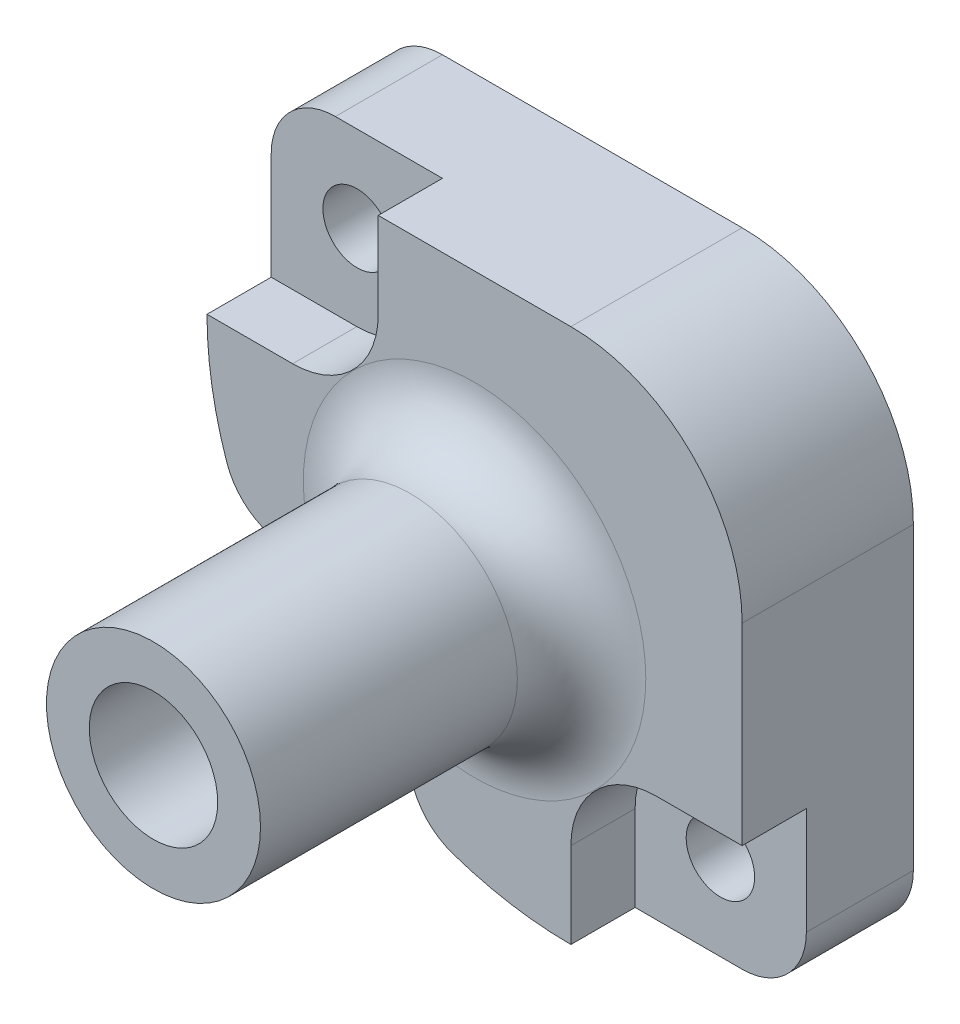
ISO-10303-21;
HEADER;
FILE_DESCRIPTION(('STEP AP214'),'2;1');
FILE_NAME('part.step','',(''),(''),'','','');
FILE_SCHEMA(('AUTOMOTIVE_DESIGN { 1 0 10303 214 1 1 1 1 }'));
ENDSEC;
DATA;
#1=APPLICATION_CONTEXT('core data for automotive mechanical design processes');
#2=APPLICATION_PROTOCOL_DEFINITION('international standard','automotive_design',2000,#1);
#3=PRODUCT_CONTEXT('',#1,'mechanical');
#4=PRODUCT('Part','Part','',(#3));
#5=PRODUCT_RELATED_PRODUCT_CATEGORY('part','',(#4));
#6=PRODUCT_DEFINITION_FORMATION('','',#4);
#7=PRODUCT_DEFINITION_CONTEXT('part definition',#1,'design');
#8=PRODUCT_DEFINITION('design','',#6,#7);
#9=PRODUCT_DEFINITION_SHAPE('','',#8);
#10=(LENGTH_UNIT() NAMED_UNIT(*) SI_UNIT(.MILLI.,.METRE.));
#11=(NAMED_UNIT(*) PLANE_ANGLE_UNIT() SI_UNIT($,.RADIAN.));
#12=(NAMED_UNIT(*) SI_UNIT($,.STERADIAN.) SOLID_ANGLE_UNIT());
#13=UNCERTAINTY_MEASURE_WITH_UNIT(LENGTH_MEASURE(1.E-05),#10,'distance_accuracy_value','');
#14=(GEOMETRIC_REPRESENTATION_CONTEXT(3) GLOBAL_UNCERTAINTY_ASSIGNED_CONTEXT((#13)) GLOBAL_UNIT_ASSIGNED_CONTEXT((#10,
#11,#12)) REPRESENTATION_CONTEXT('',''));
#15=CARTESIAN_POINT('',(0.,0.,0.));
#16=DIRECTION('',(0.,0.,1.));
#17=DIRECTION('',(1.,0.,0.));
#18=AXIS2_PLACEMENT_3D('',#15,#16,#17);
#19=CARTESIAN_POINT('',(0.,0.,8.));
#20=DIRECTION('',(0.,0.,1.));
#21=DIRECTION('',(1.,0.,0.));
#22=AXIS2_PLACEMENT_3D('',#19,#20,#21);
#23=PLANE('',#22);
#24=DIRECTION('',(0.,1.,0.));
#25=VECTOR('',#24,1.);
#26=CARTESIAN_POINT('',(12.5,12.5,8.));
#27=LINE('',#26,#25);
#28=CARTESIAN_POINT('',(12.5,-4.5,8.));
#29=VERTEX_POINT('',#28);
#30=CARTESIAN_POINT('',(12.5,4.5,8.));
#31=VERTEX_POINT('',#30);
#32=EDGE_CURVE('E281',#29,#31,#27,.T.);
#33=ORIENTED_EDGE('',*,*,#32,.T.);
#34=CARTESIAN_POINT('',(4.5,4.5,8.));
#35=DIRECTION('',(0.,0.,1.));
#36=DIRECTION('',(1.,0.,0.));
#37=AXIS2_PLACEMENT_3D('',#34,#35,#36);
#38=CIRCLE('',#37,8.);
#39=CARTESIAN_POINT('',(4.5,12.5,8.));
#40=VERTEX_POINT('',#39);
#41=EDGE_CURVE('E11',#31,#40,#38,.T.);
#42=ORIENTED_EDGE('',*,*,#41,.T.);
#43=DIRECTION('',(-1.,0.,0.));
#44=VECTOR('',#43,1.);
#45=CARTESIAN_POINT('',(-12.5,12.5,8.));
#46=LINE('',#45,#44);
#47=CARTESIAN_POINT('',(-4.5,12.5,8.));
#48=VERTEX_POINT('',#47);
#49=EDGE_CURVE('E264',#40,#48,#46,.T.);
#50=ORIENTED_EDGE('',*,*,#49,.T.);
#51=DIRECTION('',(0.,-1.,0.));
#52=VECTOR('',#51,1.);
#53=CARTESIAN_POINT('',(-4.5,0.,8.));
#54=LINE('',#53,#52);
#55=CARTESIAN_POINT('',(-4.5,8.5,8.));
#56=VERTEX_POINT('',#55);
#57=EDGE_CURVE('E313',#48,#56,#54,.T.);
#58=ORIENTED_EDGE('',*,*,#57,.T.);
#59=CARTESIAN_POINT('',(-8.5,8.5,8.));
#60=DIRECTION('',(0.,0.,1.));
#61=DIRECTION('',(1.,0.,0.));
#62=AXIS2_PLACEMENT_3D('',#59,#60,#61);
#63=CIRCLE('',#62,4.);
#64=CARTESIAN_POINT('',(-8.5,4.5,8.));
#65=VERTEX_POINT('',#64);
#66=EDGE_CURVE('E216',#56,#65,#63,.F.);
#67=ORIENTED_EDGE('',*,*,#66,.T.);
#68=DIRECTION('',(-1.,0.,0.));
#69=VECTOR('',#68,1.);
#70=CARTESIAN_POINT('',(0.,4.5,8.));
#71=LINE('',#70,#69);
#72=CARTESIAN_POINT('',(-12.5,4.5,8.));
#73=VERTEX_POINT('',#72);
#74=EDGE_CURVE('E212',#65,#73,#71,.T.);
#75=ORIENTED_EDGE('',*,*,#74,.T.);
#76=CARTESIAN_POINT('',(4.5,4.5,8.));
#77=DIRECTION('',(0.,0.,-1.));
#78=DIRECTION('',(1.,0.,0.));
#79=AXIS2_PLACEMENT_3D('',#76,#77,#78);
#80=CIRCLE('',#79,17.);
#81=CARTESIAN_POINT('',(-11.5745148344292,-1.0326280227137,8.));
#82=VERTEX_POINT('',#81);
#83=EDGE_CURVE('E450',#82,#73,#80,.T.);
#84=ORIENTED_EDGE('',*,*,#83,.F.);
#85=CARTESIAN_POINT('',(-8.73783574600049,-0.0562819010583382,8.));
#86=DIRECTION('',(0.,0.,1.));
#87=DIRECTION('',(1.,0.,0.));
#88=AXIS2_PLACEMENT_3D('',#85,#86,#87);
#89=CIRCLE('',#88,3.);
#90=CARTESIAN_POINT('',(-9.60602749692345,-2.92790915466026,8.));
#91=VERTEX_POINT('',#90);
#92=EDGE_CURVE('E224',#82,#91,#89,.T.);
#93=ORIENTED_EDGE('',*,*,#92,.T.);
#94=CARTESIAN_POINT('',(-12.5,-12.5,8.));
#95=DIRECTION('',(0.,0.,1.));
#96=DIRECTION('',(-1.,0.,0.));
#97=AXIS2_PLACEMENT_3D('',#94,#95,#96);
#98=CIRCLE('',#97,10.);
#99=CARTESIAN_POINT('',(-6.72125983731509,-4.3387401626849,8.));
#100=VERTEX_POINT('',#99);
#101=EDGE_CURVE('E189',#100,#91,#98,.T.);
#102=ORIENTED_EDGE('',*,*,#101,.F.);
#103=CARTESIAN_POINT('',(0.,0.,8.));
#104=DIRECTION('',(0.,0.,1.));
#105=DIRECTION('',(1.,0.,0.));
#106=AXIS2_PLACEMENT_3D('',#103,#104,#105);
#107=CIRCLE('',#106,8.);
#108=CARTESIAN_POINT('',(-4.33874016268491,-6.72125983731509,8.));
#109=VERTEX_POINT('',#108);
#110=EDGE_CURVE('E195',#100,#109,#107,.F.);
#111=ORIENTED_EDGE('',*,*,#110,.T.);
#112=CARTESIAN_POINT('',(-2.92790915466026,-9.60602749692345,8.));
#113=VERTEX_POINT('',#112);
#114=EDGE_CURVE('E458',#113,#109,#98,.T.);
#115=ORIENTED_EDGE('',*,*,#114,.F.);
#116=CARTESIAN_POINT('',(-0.05628190105834,-8.73783574600048,8.));
#117=DIRECTION('',(0.,0.,1.));
#118=DIRECTION('',(1.,0.,0.));
#119=AXIS2_PLACEMENT_3D('',#116,#117,#118);
#120=CIRCLE('',#119,3.);
#121=CARTESIAN_POINT('',(-1.0326280227137,-11.5745148344292,8.));
#122=VERTEX_POINT('',#121);
#123=EDGE_CURVE('E188',#113,#122,#120,.T.);
#124=ORIENTED_EDGE('',*,*,#123,.T.);
#125=CARTESIAN_POINT('',(4.5,4.5,8.));
#126=DIRECTION('',(0.,0.,-1.));
#127=DIRECTION('',(1.,0.,0.));
#128=AXIS2_PLACEMENT_3D('',#125,#126,#127);
#129=CIRCLE('',#128,17.);
#130=CARTESIAN_POINT('',(4.5,-12.5,8.));
#131=VERTEX_POINT('',#130);
#132=EDGE_CURVE('E172',#131,#122,#129,.T.);
#133=ORIENTED_EDGE('',*,*,#132,.F.);
#134=DIRECTION('',(0.,1.,0.));
#135=VECTOR('',#134,1.);
#136=CARTESIAN_POINT('',(4.5,0.,8.));
#137=LINE('',#136,#135);
#138=CARTESIAN_POINT('',(4.5,-8.5,8.));
#139=VERTEX_POINT('',#138);
#140=EDGE_CURVE('E186',#131,#139,#137,.T.);
#141=ORIENTED_EDGE('',*,*,#140,.T.);
#142=CARTESIAN_POINT('',(8.5,-8.5,8.));
#143=DIRECTION('',(0.,0.,1.));
#144=DIRECTION('',(1.,0.,0.));
#145=AXIS2_PLACEMENT_3D('',#142,#143,#144);
#146=CIRCLE('',#145,4.);
#147=CARTESIAN_POINT('',(8.5,-4.5,8.));
#148=VERTEX_POINT('',#147);
#149=EDGE_CURVE('E194',#139,#148,#146,.F.);
#150=ORIENTED_EDGE('',*,*,#149,.T.);
#151=DIRECTION('',(1.,0.,0.));
#152=VECTOR('',#151,1.);
#153=CARTESIAN_POINT('',(0.,-4.5,8.));
#154=LINE('',#153,#152);
#155=EDGE_CURVE('E197',#148,#29,#154,.T.);
#156=ORIENTED_EDGE('',*,*,#155,.T.);
#157=EDGE_LOOP('',(#33,#42,#50,#58,#67,#75,#84,#93,#102,#111,#115,#124,#133,#141,#150,#156));
#158=FACE_BOUND('',#157,.T.);
#159=ADVANCED_FACE('F32',(#158),#23,.T.);
#160=CARTESIAN_POINT('',(-12.5,12.5,8.));
#161=DIRECTION('',(1.,0.,0.));
#162=DIRECTION('',(0.,1.,0.));
#163=AXIS2_PLACEMENT_3D('',#160,#161,#162);
#164=PLANE('',#163);
#165=DIRECTION('',(0.,-1.,0.));
#166=VECTOR('',#165,1.);
#167=CARTESIAN_POINT('',(-12.5,12.5,5.));
#168=LINE('',#167,#166);
#169=CARTESIAN_POINT('',(-12.5,9.5,5.));
#170=VERTEX_POINT('',#169);
#171=CARTESIAN_POINT('',(-12.5,4.50000000000001,5.));
#172=VERTEX_POINT('',#171);
#173=EDGE_CURVE('E432',#170,#172,#168,.T.);
#174=ORIENTED_EDGE('',*,*,#173,.F.);
#175=DIRECTION('',(0.,0.,-1.));
#176=VECTOR('',#175,1.);
#177=CARTESIAN_POINT('',(-12.5,9.5,8.));
#178=LINE('',#177,#176);
#179=CARTESIAN_POINT('',(-12.5,9.5,0.));
#180=VERTEX_POINT('',#179);
#181=EDGE_CURVE('E248',#170,#180,#178,.T.);
#182=ORIENTED_EDGE('',*,*,#181,.T.);
#183=DIRECTION('',(0.,-1.,0.));
#184=VECTOR('',#183,1.);
#185=CARTESIAN_POINT('',(-12.5,12.5,0.));
#186=LINE('',#185,#184);
#187=CARTESIAN_POINT('',(-12.5,4.50000000000001,0.));
#188=VERTEX_POINT('',#187);
#189=EDGE_CURVE('E270',#180,#188,#186,.T.);
#190=ORIENTED_EDGE('',*,*,#189,.T.);
#191=DIRECTION('',(0.,0.,1.));
#192=VECTOR('',#191,1.);
#193=CARTESIAN_POINT('',(-12.5,4.50000000000001,-0.000999999999999265));
#194=LINE('',#193,#192);
#195=EDGE_CURVE('E436',#188,#172,#194,.T.);
#196=ORIENTED_EDGE('',*,*,#195,.T.);
#197=EDGE_LOOP('',(#174,#182,#190,#196));
#198=FACE_BOUND('',#197,.T.);
#199=ADVANCED_FACE('F380',(#198),#164,.F.);
#200=CARTESIAN_POINT('',(0.,0.,11.));
#201=DIRECTION('',(0.,0.,1.));
#202=DIRECTION('',(1.,0.,0.));
#203=AXIS2_PLACEMENT_3D('',#200,#201,#202);
#204=TOROIDAL_SURFACE('',#203,8.,3.);
#205=CARTESIAN_POINT('',(0.,0.,11.));
#206=DIRECTION('',(0.,0.,1.));
#207=DIRECTION('',(1.,0.,0.));
#208=AXIS2_PLACEMENT_3D('',#205,#206,#207);
#209=CIRCLE('',#208,5.);
#210=CARTESIAN_POINT('',(5.,0.,11.));
#211=VERTEX_POINT('',#210);
#212=EDGE_CURVE('E200',#211,#211,#209,.T.);
#213=ORIENTED_EDGE('',*,*,#212,.F.);
#214=EDGE_LOOP('',(#213));
#215=FACE_BOUND('',#214,.T.);
#216=CARTESIAN_POINT('',(-8.0002,-3.56961367241036,8.09797860831727));
#217=CARTESIAN_POINT('',(-7.91677202306134,-3.61164648391033,8.08250420546409));
#218=CARTESIAN_POINT('',(-7.83362398148788,-3.65501326134908,8.06939633672682));
#219=CARTESIAN_POINT('',(-7.66822082935376,-3.74427516121174,8.04722295916117));
#220=CARTESIAN_POINT('',(-7.58596513213619,-3.79016848471376,8.03815461493371));
#221=CARTESIAN_POINT('',(-7.34135671651867,-3.9312341942512,8.01599238262356));
#222=CARTESIAN_POINT('',(-7.18065241772372,-4.0300490979574,8.00785582468682));
#223=CARTESIAN_POINT('',(-6.86432974609043,-4.23712133389748,7.99952288049581));
#224=CARTESIAN_POINT('',(-6.70873751279132,-4.34541915423842,7.99936238807471));
#225=CARTESIAN_POINT('',(-6.40385458851527,-4.57075252468082,8.00234664172848));
#226=CARTESIAN_POINT('',(-6.25456932551131,-4.6877953705058,8.00549417685275));
#227=CARTESIAN_POINT('',(-6.00098892080355,-4.89852069853943,8.01069726592842));
#228=CARTESIAN_POINT('',(-5.89512493323205,-4.9903224468951,8.01282334488189));
#229=CARTESIAN_POINT('',(-5.68733020031243,-5.17830911467539,8.01597966211842));
#230=CARTESIAN_POINT('',(-5.58539961743265,-5.27449421479619,8.01700985518277));
#231=CARTESIAN_POINT('',(-5.38562789409831,-5.47110537965342,8.0175651127217));
#232=CARTESIAN_POINT('',(-5.28778845753746,-5.57153317707682,8.01708955628008));
#233=CARTESIAN_POINT('',(-5.09642846716966,-5.7764015910254,8.01481671817992));
#234=CARTESIAN_POINT('',(-5.00290780091381,-5.88084210294065,8.01301947095522));
#235=CARTESIAN_POINT('',(-4.82075526107133,-6.09307646288794,8.0088631805911));
#236=CARTESIAN_POINT('',(-4.73210333429895,-6.20085316173951,8.00650669442));
#237=CARTESIAN_POINT('',(-4.55936778127813,-6.42004669781151,8.00245318599858));
#238=CARTESIAN_POINT('',(-4.47528476853947,-6.53146402069096,8.00075625212506));
#239=CARTESIAN_POINT('',(-4.3119499092999,-6.75759064442584,7.99963414479346));
#240=CARTESIAN_POINT('',(-4.23269213035444,-6.8722956370003,8.00020612208313));
#241=CARTESIAN_POINT('',(-4.07909755574588,-7.10483556530485,8.00550807479713));
#242=CARTESIAN_POINT('',(-4.00475884116797,-7.22266925510044,8.01023641842801));
#243=CARTESIAN_POINT('',(-3.90052352256665,-7.3957886502315,8.02164171537481));
#244=CARTESIAN_POINT('',(-3.86857210812433,-7.45000923333885,8.02583565953694));
#245=CARTESIAN_POINT('',(-3.8057561782058,-7.55893978739272,8.03570699775149));
#246=CARTESIAN_POINT('',(-3.77489157150448,-7.61364971677844,8.04138426695725));
#247=CARTESIAN_POINT('',(-3.71428590739145,-7.72347831702353,8.05442566410242));
#248=CARTESIAN_POINT('',(-3.68454463933236,-7.77859690890852,8.06178947393556));
#249=CARTESIAN_POINT('',(-3.62620806887594,-7.88917236883095,8.07841165799861));
#250=CARTESIAN_POINT('',(-3.59761308257272,-7.94462932538264,8.08767055056943));
#251=CARTESIAN_POINT('',(-3.56961367241036,-8.0002,8.09797860831727));
#252=B_SPLINE_CURVE_WITH_KNOTS('',3,(#216,#217,#218,#219,#220,#221,#222,#223,#224,#225,#226,
#227,#228,#229,#230,#231,#232,#233,#234,#235,#236,#237,#238,#239,#240,#241,#242,#243,#244,#245,
#246,#247,#248,#249,#250,#251),.UNSPECIFIED.,.F.,.F.,(4,2,2,2,2,2,2,2,2,2,2,2,2,2,2,2,2,4),(0.,
0.283971436551185,0.567743234260273,1.13356130072625,1.7019254281237,2.27076913685484,
2.6910736190946,3.11139544336873,3.5318906156074,3.95237483312736,4.3709723337647,
4.78962590510569,5.20775390638838,5.62571782349349,5.81491719176248,6.00410064086194,
6.19324843653463,6.38244803700309),.UNSPECIFIED.);
#253=EDGE_CURVE('E441',#100,#109,#252,.T.);
#254=ORIENTED_EDGE('',*,*,#253,.T.);
#255=ORIENTED_EDGE('',*,*,#110,.F.);
#256=EDGE_LOOP('',(#254,#255));
#257=FACE_BOUND('',#256,.T.);
#258=ADVANCED_FACE('F385',(#215,#257),#204,.F.);
#259=CARTESIAN_POINT('',(-12.5,12.5,8.));
#260=DIRECTION('',(0.,-1.,0.));
#261=DIRECTION('',(0.,0.,-1.));
#262=AXIS2_PLACEMENT_3D('',#259,#260,#261);
#263=PLANE('',#262);
#264=ORIENTED_EDGE('',*,*,#49,.F.);
#265=DIRECTION('',(0.,0.,-1.));
#266=VECTOR('',#265,1.);
#267=CARTESIAN_POINT('',(4.5,12.5,8.));
#268=LINE('',#267,#266);
#269=CARTESIAN_POINT('',(4.5,12.5,0.));
#270=VERTEX_POINT('',#269);
#271=EDGE_CURVE('E255',#40,#270,#268,.T.);
#272=ORIENTED_EDGE('',*,*,#271,.T.);
#273=DIRECTION('',(-1.,0.,0.));
#274=VECTOR('',#273,1.);
#275=CARTESIAN_POINT('',(-12.5,12.5,0.));
#276=LINE('',#275,#274);
#277=CARTESIAN_POINT('',(-9.5,12.5,0.));
#278=VERTEX_POINT('',#277);
#279=EDGE_CURVE('E262',#270,#278,#276,.T.);
#280=ORIENTED_EDGE('',*,*,#279,.T.);
#281=DIRECTION('',(0.,0.,-1.));
#282=VECTOR('',#281,1.);
#283=CARTESIAN_POINT('',(-9.5,12.5,8.));
#284=LINE('',#283,#282);
#285=CARTESIAN_POINT('',(-9.5,12.5,5.));
#286=VERTEX_POINT('',#285);
#287=EDGE_CURVE('E251',#278,#286,#284,.F.);
#288=ORIENTED_EDGE('',*,*,#287,.T.);
#289=DIRECTION('',(-1.,0.,0.));
#290=VECTOR('',#289,1.);
#291=CARTESIAN_POINT('',(-4.5,12.5,5.));
#292=LINE('',#291,#290);
#293=CARTESIAN_POINT('',(-4.5,12.5,5.));
#294=VERTEX_POINT('',#293);
#295=EDGE_CURVE('E325',#294,#286,#292,.T.);
#296=ORIENTED_EDGE('',*,*,#295,.F.);
#297=DIRECTION('',(0.,0.,-1.));
#298=VECTOR('',#297,1.);
#299=CARTESIAN_POINT('',(-4.5,12.5,23.));
#300=LINE('',#299,#298);
#301=EDGE_CURVE('E318',#48,#294,#300,.T.);
#302=ORIENTED_EDGE('',*,*,#301,.F.);
#303=EDGE_LOOP('',(#264,#272,#280,#288,#296,#302));
#304=FACE_BOUND('',#303,.T.);
#305=ADVANCED_FACE('F261',(#304),#263,.F.);
#306=CARTESIAN_POINT('',(12.5,12.5,8.));
#307=DIRECTION('',(-1.,0.,0.));
#308=DIRECTION('',(0.,-1.,0.));
#309=AXIS2_PLACEMENT_3D('',#306,#307,#308);
#310=PLANE('',#309);
#311=DIRECTION('',(0.,1.,0.));
#312=VECTOR('',#311,1.);
#313=CARTESIAN_POINT('',(12.5,12.5,0.));
#314=LINE('',#313,#312);
#315=CARTESIAN_POINT('',(12.5,-9.5,0.));
#316=VERTEX_POINT('',#315);
#317=CARTESIAN_POINT('',(12.5,4.5,0.));
#318=VERTEX_POINT('',#317);
#319=EDGE_CURVE('E271',#316,#318,#314,.T.);
#320=ORIENTED_EDGE('',*,*,#319,.T.);
#321=DIRECTION('',(0.,0.,-1.));
#322=VECTOR('',#321,1.);
#323=CARTESIAN_POINT('',(12.5,4.5,8.));
#324=LINE('',#323,#322);
#325=EDGE_CURVE('E40',#318,#31,#324,.F.);
#326=ORIENTED_EDGE('',*,*,#325,.T.);
#327=ORIENTED_EDGE('',*,*,#32,.F.);
#328=DIRECTION('',(0.,0.,-1.));
#329=VECTOR('',#328,1.);
#330=CARTESIAN_POINT('',(12.5,-4.5,23.));
#331=LINE('',#330,#329);
#332=CARTESIAN_POINT('',(12.5,-4.5,5.));
#333=VERTEX_POINT('',#332);
#334=EDGE_CURVE('E350',#29,#333,#331,.T.);
#335=ORIENTED_EDGE('',*,*,#334,.T.);
#336=DIRECTION('',(0.,1.,0.));
#337=VECTOR('',#336,1.);
#338=CARTESIAN_POINT('',(12.5,-12.5,5.));
#339=LINE('',#338,#337);
#340=CARTESIAN_POINT('',(12.5,-9.5,5.));
#341=VERTEX_POINT('',#340);
#342=EDGE_CURVE('E338',#341,#333,#339,.T.);
#343=ORIENTED_EDGE('',*,*,#342,.F.);
#344=DIRECTION('',(0.,0.,-1.));
#345=VECTOR('',#344,1.);
#346=CARTESIAN_POINT('',(12.5,-9.5,8.));
#347=LINE('',#346,#345);
#348=EDGE_CURVE('E236',#341,#316,#347,.T.);
#349=ORIENTED_EDGE('',*,*,#348,.T.);
#350=EDGE_LOOP('',(#320,#326,#327,#335,#343,#349));
#351=FACE_BOUND('',#350,.T.);
#352=ADVANCED_FACE('F398',(#351),#310,.F.);
#353=CARTESIAN_POINT('',(-12.5,-12.5,8.));
#354=DIRECTION('',(0.,1.,0.));
#355=DIRECTION('',(0.,0.,1.));
#356=AXIS2_PLACEMENT_3D('',#353,#354,#355);
#357=PLANE('',#356);
#358=DIRECTION('',(1.,0.,0.));
#359=VECTOR('',#358,1.);
#360=CARTESIAN_POINT('',(-12.5,-12.5,0.));
#361=LINE('',#360,#359);
#362=CARTESIAN_POINT('',(4.5,-12.5,0.));
#363=VERTEX_POINT('',#362);
#364=CARTESIAN_POINT('',(9.5,-12.5,0.));
#365=VERTEX_POINT('',#364);
#366=EDGE_CURVE('E273',#363,#365,#361,.T.);
#367=ORIENTED_EDGE('',*,*,#366,.T.);
#368=DIRECTION('',(0.,0.,-1.));
#369=VECTOR('',#368,1.);
#370=CARTESIAN_POINT('',(9.5,-12.5,8.));
#371=LINE('',#370,#369);
#372=CARTESIAN_POINT('',(9.5,-12.5,5.));
#373=VERTEX_POINT('',#372);
#374=EDGE_CURVE('E244',#365,#373,#371,.F.);
#375=ORIENTED_EDGE('',*,*,#374,.T.);
#376=DIRECTION('',(1.,0.,0.));
#377=VECTOR('',#376,1.);
#378=CARTESIAN_POINT('',(4.5,-12.5,5.));
#379=LINE('',#378,#377);
#380=CARTESIAN_POINT('',(4.5,-12.5,5.));
#381=VERTEX_POINT('',#380);
#382=EDGE_CURVE('E321',#381,#373,#379,.T.);
#383=ORIENTED_EDGE('',*,*,#382,.F.);
#384=DIRECTION('',(0.,0.,1.));
#385=VECTOR('',#384,1.);
#386=CARTESIAN_POINT('',(4.5,-12.5,-0.000999999999999265));
#387=LINE('',#386,#385);
#388=EDGE_CURVE('E175',#363,#381,#387,.T.);
#389=ORIENTED_EDGE('',*,*,#388,.F.);
#390=EDGE_LOOP('',(#367,#375,#383,#389));
#391=FACE_BOUND('',#390,.T.);
#392=ADVANCED_FACE('F396',(#391),#357,.F.);
#393=CARTESIAN_POINT('',(0.,0.,23.001));
#394=DIRECTION('',(0.,0.,-1.));
#395=DIRECTION('',(-1.,0.,0.));
#396=AXIS2_PLACEMENT_3D('',#393,#394,#395);
#397=CYLINDRICAL_SURFACE('',#396,1.6);
#398=CARTESIAN_POINT('',(0.,0.,4.));
#399=DIRECTION('',(0.,0.,-1.));
#400=DIRECTION('',(-1.,0.,0.));
#401=AXIS2_PLACEMENT_3D('',#398,#399,#400);
#402=CIRCLE('',#401,1.6);
#403=CARTESIAN_POINT('',(-1.6,0.,4.));
#404=VERTEX_POINT('',#403);
#405=EDGE_CURVE('E284',#404,#404,#402,.F.);
#406=ORIENTED_EDGE('',*,*,#405,.F.);
#407=EDGE_LOOP('',(#406));
#408=FACE_BOUND('',#407,.T.);
#409=CARTESIAN_POINT('',(0.,0.,7.));
#410=DIRECTION('',(0.,0.,1.));
#411=DIRECTION('',(1.,0.,0.));
#412=AXIS2_PLACEMENT_3D('',#409,#410,#411);
#413=CIRCLE('',#412,1.6);
#414=CARTESIAN_POINT('',(1.6,0.,7.));
#415=VERTEX_POINT('',#414);
#416=EDGE_CURVE('E287',#415,#415,#413,.F.);
#417=ORIENTED_EDGE('',*,*,#416,.F.);
#418=EDGE_LOOP('',(#417));
#419=FACE_BOUND('',#418,.T.);
#420=ADVANCED_FACE('F394',(#408,#419),#397,.F.);
#421=CARTESIAN_POINT('',(0.,0.,0.));
#422=DIRECTION('',(0.,0.,1.));
#423=DIRECTION('',(1.,0.,0.));
#424=AXIS2_PLACEMENT_3D('',#421,#422,#423);
#425=PLANE('',#424);
#426=CARTESIAN_POINT('',(8.48528137423857,-8.48528137423857,0.));
#427=DIRECTION('',(0.,0.,-1.));
#428=DIRECTION('',(-1.,0.,0.));
#429=AXIS2_PLACEMENT_3D('',#426,#427,#428);
#430=CIRCLE('',#429,1.6);
#431=CARTESIAN_POINT('',(6.88528137423857,-8.48528137423857,0.));
#432=VERTEX_POINT('',#431);
#433=EDGE_CURVE('E301',#432,#432,#430,.T.);
#434=ORIENTED_EDGE('',*,*,#433,.F.);
#435=EDGE_LOOP('',(#434));
#436=FACE_BOUND('',#435,.T.);
#437=CARTESIAN_POINT('',(-8.48528137423857,8.48528137423857,0.));
#438=DIRECTION('',(0.,0.,-1.));
#439=DIRECTION('',(-1.,0.,0.));
#440=AXIS2_PLACEMENT_3D('',#437,#438,#439);
#441=CIRCLE('',#440,1.6);
#442=CARTESIAN_POINT('',(-10.0852813742386,8.48528137423857,0.));
#443=VERTEX_POINT('',#442);
#444=EDGE_CURVE('E304',#443,#443,#441,.T.);
#445=ORIENTED_EDGE('',*,*,#444,.F.);
#446=EDGE_LOOP('',(#445));
#447=FACE_BOUND('',#446,.T.);
#448=CARTESIAN_POINT('',(0.,0.,0.));
#449=DIRECTION('',(0.,0.,-1.));
#450=DIRECTION('',(-1.,0.,0.));
#451=AXIS2_PLACEMENT_3D('',#448,#449,#450);
#452=CIRCLE('',#451,3.);
#453=CARTESIAN_POINT('',(-3.,0.,0.));
#454=VERTEX_POINT('',#453);
#455=EDGE_CURVE('E289',#454,#454,#452,.T.);
#456=ORIENTED_EDGE('',*,*,#455,.F.);
#457=EDGE_LOOP('',(#456));
#458=FACE_BOUND('',#457,.T.);
#459=ORIENTED_EDGE('',*,*,#279,.F.);
#460=CARTESIAN_POINT('',(4.5,4.5,0.));
#461=DIRECTION('',(0.,0.,1.));
#462=DIRECTION('',(1.,0.,0.));
#463=AXIS2_PLACEMENT_3D('',#460,#461,#462);
#464=CIRCLE('',#463,8.);
#465=EDGE_CURVE('E54',#270,#318,#464,.F.);
#466=ORIENTED_EDGE('',*,*,#465,.T.);
#467=ORIENTED_EDGE('',*,*,#319,.F.);
#468=CARTESIAN_POINT('',(9.5,-9.5,0.));
#469=DIRECTION('',(0.,0.,1.));
#470=DIRECTION('',(1.,0.,0.));
#471=AXIS2_PLACEMENT_3D('',#468,#469,#470);
#472=CIRCLE('',#471,3.);
#473=EDGE_CURVE('E242',#316,#365,#472,.F.);
#474=ORIENTED_EDGE('',*,*,#473,.T.);
#475=ORIENTED_EDGE('',*,*,#366,.F.);
#476=CARTESIAN_POINT('',(4.5,4.5,0.));
#477=DIRECTION('',(0.,0.,1.));
#478=DIRECTION('',(1.,0.,0.));
#479=AXIS2_PLACEMENT_3D('',#476,#477,#478);
#480=CIRCLE('',#479,17.);
#481=CARTESIAN_POINT('',(-1.0326280227137,-11.5745148344292,0.));
#482=VERTEX_POINT('',#481);
#483=EDGE_CURVE('E493',#482,#363,#480,.T.);
#484=ORIENTED_EDGE('',*,*,#483,.F.);
#485=CARTESIAN_POINT('',(-0.05628190105834,-8.73783574600048,0.));
#486=DIRECTION('',(0.,0.,1.));
#487=DIRECTION('',(1.,0.,0.));
#488=AXIS2_PLACEMENT_3D('',#485,#486,#487);
#489=CIRCLE('',#488,3.);
#490=CARTESIAN_POINT('',(-2.92790915466026,-9.60602749692345,0.));
#491=VERTEX_POINT('',#490);
#492=EDGE_CURVE('E231',#482,#491,#489,.F.);
#493=ORIENTED_EDGE('',*,*,#492,.T.);
#494=CARTESIAN_POINT('',(-12.5,-12.5,0.));
#495=DIRECTION('',(0.,0.,1.));
#496=DIRECTION('',(1.,0.,0.));
#497=AXIS2_PLACEMENT_3D('',#494,#495,#496);
#498=CIRCLE('',#497,10.);
#499=CARTESIAN_POINT('',(-9.60602749692345,-2.92790915466026,0.));
#500=VERTEX_POINT('',#499);
#501=EDGE_CURVE('E488',#500,#491,#498,.F.);
#502=ORIENTED_EDGE('',*,*,#501,.F.);
#503=CARTESIAN_POINT('',(-8.73783574600049,-0.0562819010583382,0.));
#504=DIRECTION('',(0.,0.,1.));
#505=DIRECTION('',(1.,0.,0.));
#506=AXIS2_PLACEMENT_3D('',#503,#504,#505);
#507=CIRCLE('',#506,3.);
#508=CARTESIAN_POINT('',(-11.5745148344292,-1.0326280227137,0.));
#509=VERTEX_POINT('',#508);
#510=EDGE_CURVE('E229',#500,#509,#507,.F.);
#511=ORIENTED_EDGE('',*,*,#510,.T.);
#512=CARTESIAN_POINT('',(4.5,4.5,0.));
#513=DIRECTION('',(0.,0.,1.));
#514=DIRECTION('',(1.,0.,0.));
#515=AXIS2_PLACEMENT_3D('',#512,#513,#514);
#516=CIRCLE('',#515,17.);
#517=EDGE_CURVE('E190',#188,#509,#516,.T.);
#518=ORIENTED_EDGE('',*,*,#517,.F.);
#519=ORIENTED_EDGE('',*,*,#189,.F.);
#520=CARTESIAN_POINT('',(-9.5,9.5,0.));
#521=DIRECTION('',(0.,0.,1.));
#522=DIRECTION('',(1.,0.,0.));
#523=AXIS2_PLACEMENT_3D('',#520,#521,#522);
#524=CIRCLE('',#523,3.);
#525=EDGE_CURVE('E239',#180,#278,#524,.F.);
#526=ORIENTED_EDGE('',*,*,#525,.T.);
#527=EDGE_LOOP('',(#459,#466,#467,#474,#475,#484,#493,#502,#511,#518,#519,#526));
#528=FACE_BOUND('',#527,.T.);
#529=ADVANCED_FACE('F267',(#436,#447,#458,#528),#425,.F.);
#530=CARTESIAN_POINT('',(0.,0.,23.));
#531=DIRECTION('',(0.,0.,-1.));
#532=DIRECTION('',(-1.,0.,0.));
#533=AXIS2_PLACEMENT_3D('',#530,#531,#532);
#534=CYLINDRICAL_SURFACE('',#533,5.);
#535=ORIENTED_EDGE('',*,*,#212,.T.);
#536=EDGE_LOOP('',(#535));
#537=FACE_BOUND('',#536,.T.);
#538=CARTESIAN_POINT('',(0.,0.,23.));
#539=DIRECTION('',(0.,0.,1.));
#540=DIRECTION('',(1.,0.,0.));
#541=AXIS2_PLACEMENT_3D('',#538,#539,#540);
#542=CIRCLE('',#541,5.);
#543=CARTESIAN_POINT('',(5.,0.,23.));
#544=VERTEX_POINT('',#543);
#545=EDGE_CURVE('E275',#544,#544,#542,.T.);
#546=ORIENTED_EDGE('',*,*,#545,.F.);
#547=EDGE_LOOP('',(#546));
#548=FACE_BOUND('',#547,.T.);
#549=ADVANCED_FACE('F390',(#537,#548),#534,.T.);
#550=CARTESIAN_POINT('',(0.,0.,23.));
#551=DIRECTION('',(0.,0.,1.));
#552=DIRECTION('',(1.,0.,0.));
#553=AXIS2_PLACEMENT_3D('',#550,#551,#552);
#554=PLANE('',#553);
#555=CARTESIAN_POINT('',(0.,0.,23.));
#556=DIRECTION('',(0.,0.,1.));
#557=DIRECTION('',(1.,0.,0.));
#558=AXIS2_PLACEMENT_3D('',#555,#556,#557);
#559=CIRCLE('',#558,3.);
#560=CARTESIAN_POINT('',(3.,0.,23.));
#561=VERTEX_POINT('',#560);
#562=EDGE_CURVE('E296',#561,#561,#559,.T.);
#563=ORIENTED_EDGE('',*,*,#562,.F.);
#564=EDGE_LOOP('',(#563));
#565=FACE_BOUND('',#564,.T.);
#566=ORIENTED_EDGE('',*,*,#545,.T.);
#567=EDGE_LOOP('',(#566));
#568=FACE_BOUND('',#567,.T.);
#569=ADVANCED_FACE('F532',(#565,#568),#554,.T.);
#570=CARTESIAN_POINT('',(0.,0.,4.));
#571=DIRECTION('',(0.,0.,-1.));
#572=DIRECTION('',(-1.,0.,0.));
#573=AXIS2_PLACEMENT_3D('',#570,#571,#572);
#574=PLANE('',#573);
#575=CARTESIAN_POINT('',(0.,0.,4.));
#576=DIRECTION('',(0.,0.,-1.));
#577=DIRECTION('',(-1.,0.,0.));
#578=AXIS2_PLACEMENT_3D('',#575,#576,#577);
#579=CIRCLE('',#578,3.);
#580=CARTESIAN_POINT('',(-3.,0.,4.));
#581=VERTEX_POINT('',#580);
#582=EDGE_CURVE('E286',#581,#581,#579,.T.);
#583=ORIENTED_EDGE('',*,*,#582,.T.);
#584=EDGE_LOOP('',(#583));
#585=FACE_BOUND('',#584,.T.);
#586=ORIENTED_EDGE('',*,*,#405,.T.);
#587=EDGE_LOOP('',(#586));
#588=FACE_BOUND('',#587,.T.);
#589=ADVANCED_FACE('F529',(#585,#588),#574,.T.);
#590=CARTESIAN_POINT('',(0.,0.,4.));
#591=DIRECTION('',(0.,0.,-1.));
#592=DIRECTION('',(-1.,0.,0.));
#593=AXIS2_PLACEMENT_3D('',#590,#591,#592);
#594=CYLINDRICAL_SURFACE('',#593,3.);
#595=ORIENTED_EDGE('',*,*,#582,.F.);
#596=EDGE_LOOP('',(#595));
#597=FACE_BOUND('',#596,.T.);
#598=ORIENTED_EDGE('',*,*,#455,.T.);
#599=EDGE_LOOP('',(#598));
#600=FACE_BOUND('',#599,.T.);
#601=ADVANCED_FACE('F525',(#597,#600),#594,.F.);
#602=CARTESIAN_POINT('',(0.,0.,7.));
#603=DIRECTION('',(0.,0.,1.));
#604=DIRECTION('',(1.,0.,0.));
#605=AXIS2_PLACEMENT_3D('',#602,#603,#604);
#606=PLANE('',#605);
#607=CARTESIAN_POINT('',(0.,0.,7.));
#608=DIRECTION('',(0.,0.,1.));
#609=DIRECTION('',(1.,0.,0.));
#610=AXIS2_PLACEMENT_3D('',#607,#608,#609);
#611=CIRCLE('',#610,3.);
#612=CARTESIAN_POINT('',(3.,0.,7.));
#613=VERTEX_POINT('',#612);
#614=EDGE_CURVE('E290',#613,#613,#611,.T.);
#615=ORIENTED_EDGE('',*,*,#614,.T.);
#616=EDGE_LOOP('',(#615));
#617=FACE_BOUND('',#616,.T.);
#618=ORIENTED_EDGE('',*,*,#416,.T.);
#619=EDGE_LOOP('',(#618));
#620=FACE_BOUND('',#619,.T.);
#621=ADVANCED_FACE('F522',(#617,#620),#606,.T.);
#622=CARTESIAN_POINT('',(0.,0.,7.));
#623=DIRECTION('',(0.,0.,1.));
#624=DIRECTION('',(1.,0.,0.));
#625=AXIS2_PLACEMENT_3D('',#622,#623,#624);
#626=CYLINDRICAL_SURFACE('',#625,3.);
#627=ORIENTED_EDGE('',*,*,#614,.F.);
#628=EDGE_LOOP('',(#627));
#629=FACE_BOUND('',#628,.T.);
#630=ORIENTED_EDGE('',*,*,#562,.T.);
#631=EDGE_LOOP('',(#630));
#632=FACE_BOUND('',#631,.T.);
#633=ADVANCED_FACE('F520',(#629,#632),#626,.F.);
#634=CARTESIAN_POINT('',(-8.48528137423857,8.48528137423857,23.001));
#635=DIRECTION('',(0.,0.,-1.));
#636=DIRECTION('',(-1.,0.,0.));
#637=AXIS2_PLACEMENT_3D('',#634,#635,#636);
#638=CYLINDRICAL_SURFACE('',#637,1.6);
#639=CARTESIAN_POINT('',(-8.48528137423857,8.48528137423857,5.));
#640=DIRECTION('',(0.,0.,-1.));
#641=DIRECTION('',(-1.,0.,0.));
#642=AXIS2_PLACEMENT_3D('',#639,#640,#641);
#643=CIRCLE('',#642,1.6);
#644=CARTESIAN_POINT('',(-10.0852813742386,8.48528137423857,5.));
#645=VERTEX_POINT('',#644);
#646=EDGE_CURVE('E209',#645,#645,#643,.F.);
#647=ORIENTED_EDGE('',*,*,#646,.T.);
#648=EDGE_LOOP('',(#647));
#649=FACE_BOUND('',#648,.T.);
#650=ORIENTED_EDGE('',*,*,#444,.T.);
#651=EDGE_LOOP('',(#650));
#652=FACE_BOUND('',#651,.T.);
#653=ADVANCED_FACE('F375',(#649,#652),#638,.F.);
#654=CARTESIAN_POINT('',(8.48528137423857,-8.48528137423857,23.001));
#655=DIRECTION('',(0.,0.,-1.));
#656=DIRECTION('',(-1.,0.,0.));
#657=AXIS2_PLACEMENT_3D('',#654,#655,#656);
#658=CYLINDRICAL_SURFACE('',#657,1.6);
#659=CARTESIAN_POINT('',(8.48528137423857,-8.48528137423857,5.));
#660=DIRECTION('',(0.,0.,-1.));
#661=DIRECTION('',(-1.,0.,0.));
#662=AXIS2_PLACEMENT_3D('',#659,#660,#661);
#663=CIRCLE('',#662,1.6);
#664=CARTESIAN_POINT('',(6.88528137423857,-8.48528137423857,5.));
#665=VERTEX_POINT('',#664);
#666=EDGE_CURVE('E203',#665,#665,#663,.F.);
#667=ORIENTED_EDGE('',*,*,#666,.T.);
#668=EDGE_LOOP('',(#667));
#669=FACE_BOUND('',#668,.T.);
#670=ORIENTED_EDGE('',*,*,#433,.T.);
#671=EDGE_LOOP('',(#670));
#672=FACE_BOUND('',#671,.T.);
#673=ADVANCED_FACE('F361',(#669,#672),#658,.F.);
#674=CARTESIAN_POINT('',(8.5,-8.5,5.));
#675=DIRECTION('',(0.,0.,-1.));
#676=DIRECTION('',(-1.,0.,0.));
#677=AXIS2_PLACEMENT_3D('',#674,#675,#676);
#678=PLANE('',#677);
#679=ORIENTED_EDGE('',*,*,#382,.T.);
#680=CARTESIAN_POINT('',(9.5,-9.5,5.));
#681=DIRECTION('',(0.,0.,-1.));
#682=DIRECTION('',(-1.,0.,0.));
#683=AXIS2_PLACEMENT_3D('',#680,#681,#682);
#684=CIRCLE('',#683,3.);
#685=EDGE_CURVE('E246',#373,#341,#684,.F.);
#686=ORIENTED_EDGE('',*,*,#685,.T.);
#687=ORIENTED_EDGE('',*,*,#342,.T.);
#688=DIRECTION('',(-1.,0.,0.));
#689=VECTOR('',#688,1.);
#690=CARTESIAN_POINT('',(12.5,-4.5,5.));
#691=LINE('',#690,#689);
#692=CARTESIAN_POINT('',(8.5,-4.5,5.));
#693=VERTEX_POINT('',#692);
#694=EDGE_CURVE('E340',#333,#693,#691,.T.);
#695=ORIENTED_EDGE('',*,*,#694,.T.);
#696=CARTESIAN_POINT('',(8.5,-8.5,5.));
#697=DIRECTION('',(0.,0.,1.));
#698=DIRECTION('',(-1.,0.,0.));
#699=AXIS2_PLACEMENT_3D('',#696,#697,#698);
#700=CIRCLE('',#699,4.);
#701=CARTESIAN_POINT('',(4.5,-8.5,5.));
#702=VERTEX_POINT('',#701);
#703=EDGE_CURVE('E343',#693,#702,#700,.T.);
#704=ORIENTED_EDGE('',*,*,#703,.T.);
#705=DIRECTION('',(0.,-1.,0.));
#706=VECTOR('',#705,1.);
#707=CARTESIAN_POINT('',(4.5,-12.5,5.));
#708=LINE('',#707,#706);
#709=EDGE_CURVE('E181',#702,#381,#708,.T.);
#710=ORIENTED_EDGE('',*,*,#709,.T.);
#711=EDGE_LOOP('',(#679,#686,#687,#695,#704,#710));
#712=FACE_BOUND('',#711,.T.);
#713=ORIENTED_EDGE('',*,*,#666,.F.);
#714=EDGE_LOOP('',(#713));
#715=FACE_BOUND('',#714,.T.);
#716=ADVANCED_FACE('F363',(#712,#715),#678,.F.);
#717=CARTESIAN_POINT('',(12.5,-4.5,23.));
#718=DIRECTION('',(0.,-1.,0.));
#719=DIRECTION('',(1.,0.,0.));
#720=AXIS2_PLACEMENT_3D('',#717,#718,#719);
#721=PLANE('',#720);
#722=DIRECTION('',(0.,0.,-1.));
#723=VECTOR('',#722,1.);
#724=CARTESIAN_POINT('',(8.5,-4.5,23.));
#725=LINE('',#724,#723);
#726=EDGE_CURVE('E348',#148,#693,#725,.T.);
#727=ORIENTED_EDGE('',*,*,#726,.T.);
#728=ORIENTED_EDGE('',*,*,#694,.F.);
#729=ORIENTED_EDGE('',*,*,#334,.F.);
#730=ORIENTED_EDGE('',*,*,#155,.F.);
#731=EDGE_LOOP('',(#727,#728,#729,#730));
#732=FACE_BOUND('',#731,.T.);
#733=ADVANCED_FACE('F365',(#732),#721,.T.);
#734=CARTESIAN_POINT('',(8.5,-8.5,23.));
#735=DIRECTION('',(0.,0.,-1.));
#736=DIRECTION('',(-1.,0.,0.));
#737=AXIS2_PLACEMENT_3D('',#734,#735,#736);
#738=CYLINDRICAL_SURFACE('',#737,4.);
#739=DIRECTION('',(0.,0.,-1.));
#740=VECTOR('',#739,1.);
#741=CARTESIAN_POINT('',(4.5,-8.5,23.));
#742=LINE('',#741,#740);
#743=EDGE_CURVE('E180',#139,#702,#742,.T.);
#744=ORIENTED_EDGE('',*,*,#743,.T.);
#745=ORIENTED_EDGE('',*,*,#703,.F.);
#746=ORIENTED_EDGE('',*,*,#726,.F.);
#747=ORIENTED_EDGE('',*,*,#149,.F.);
#748=EDGE_LOOP('',(#744,#745,#746,#747));
#749=FACE_BOUND('',#748,.T.);
#750=ADVANCED_FACE('F372',(#749),#738,.F.);
#751=CARTESIAN_POINT('',(4.5,-12.5,23.));
#752=DIRECTION('',(1.,0.,0.));
#753=DIRECTION('',(0.,0.,-1.));
#754=AXIS2_PLACEMENT_3D('',#751,#752,#753);
#755=PLANE('',#754);
#756=DIRECTION('',(0.,0.,-1.));
#757=VECTOR('',#756,1.);
#758=CARTESIAN_POINT('',(4.5,-12.5,23.));
#759=LINE('',#758,#757);
#760=EDGE_CURVE('E169',#131,#381,#759,.T.);
#761=ORIENTED_EDGE('',*,*,#760,.T.);
#762=ORIENTED_EDGE('',*,*,#709,.F.);
#763=ORIENTED_EDGE('',*,*,#743,.F.);
#764=ORIENTED_EDGE('',*,*,#140,.F.);
#765=EDGE_LOOP('',(#761,#762,#763,#764));
#766=FACE_BOUND('',#765,.T.);
#767=ADVANCED_FACE('F192',(#766),#755,.T.);
#768=CARTESIAN_POINT('',(-8.5,8.5,5.));
#769=DIRECTION('',(0.,0.,-1.));
#770=DIRECTION('',(1.,0.,0.));
#771=AXIS2_PLACEMENT_3D('',#768,#769,#770);
#772=PLANE('',#771);
#773=ORIENTED_EDGE('',*,*,#295,.T.);
#774=CARTESIAN_POINT('',(-9.5,9.5,5.));
#775=DIRECTION('',(0.,0.,-1.));
#776=DIRECTION('',(-1.,0.,0.));
#777=AXIS2_PLACEMENT_3D('',#774,#775,#776);
#778=CIRCLE('',#777,3.);
#779=EDGE_CURVE('E253',#286,#170,#778,.F.);
#780=ORIENTED_EDGE('',*,*,#779,.T.);
#781=ORIENTED_EDGE('',*,*,#173,.T.);
#782=DIRECTION('',(1.,0.,0.));
#783=VECTOR('',#782,1.);
#784=CARTESIAN_POINT('',(-12.5,4.5,5.));
#785=LINE('',#784,#783);
#786=CARTESIAN_POINT('',(-8.5,4.5,5.));
#787=VERTEX_POINT('',#786);
#788=EDGE_CURVE('E438',#172,#787,#785,.T.);
#789=ORIENTED_EDGE('',*,*,#788,.T.);
#790=CARTESIAN_POINT('',(-8.5,8.5,5.));
#791=DIRECTION('',(0.,0.,1.));
#792=DIRECTION('',(1.,0.,0.));
#793=AXIS2_PLACEMENT_3D('',#790,#791,#792);
#794=CIRCLE('',#793,4.);
#795=CARTESIAN_POINT('',(-4.5,8.5,5.));
#796=VERTEX_POINT('',#795);
#797=EDGE_CURVE('E329',#787,#796,#794,.T.);
#798=ORIENTED_EDGE('',*,*,#797,.T.);
#799=DIRECTION('',(0.,1.,0.));
#800=VECTOR('',#799,1.);
#801=CARTESIAN_POINT('',(-4.5,12.5,5.));
#802=LINE('',#801,#800);
#803=EDGE_CURVE('E326',#796,#294,#802,.T.);
#804=ORIENTED_EDGE('',*,*,#803,.T.);
#805=EDGE_LOOP('',(#773,#780,#781,#789,#798,#804));
#806=FACE_BOUND('',#805,.T.);
#807=ORIENTED_EDGE('',*,*,#646,.F.);
#808=EDGE_LOOP('',(#807));
#809=FACE_BOUND('',#808,.T.);
#810=ADVANCED_FACE('F429',(#806,#809),#772,.F.);
#811=CARTESIAN_POINT('',(-12.5,4.5,23.));
#812=DIRECTION('',(0.,1.,0.));
#813=DIRECTION('',(-1.,0.,0.));
#814=AXIS2_PLACEMENT_3D('',#811,#812,#813);
#815=PLANE('',#814);
#816=DIRECTION('',(0.,0.,-1.));
#817=VECTOR('',#816,1.);
#818=CARTESIAN_POINT('',(-8.5,4.5,23.));
#819=LINE('',#818,#817);
#820=EDGE_CURVE('E213',#65,#787,#819,.T.);
#821=ORIENTED_EDGE('',*,*,#820,.T.);
#822=ORIENTED_EDGE('',*,*,#788,.F.);
#823=DIRECTION('',(0.,0.,1.));
#824=VECTOR('',#823,1.);
#825=CARTESIAN_POINT('',(-12.5,4.5,8.));
#826=LINE('',#825,#824);
#827=EDGE_CURVE('E208',#172,#73,#826,.T.);
#828=ORIENTED_EDGE('',*,*,#827,.T.);
#829=ORIENTED_EDGE('',*,*,#74,.F.);
#830=EDGE_LOOP('',(#821,#822,#828,#829));
#831=FACE_BOUND('',#830,.T.);
#832=ADVANCED_FACE('F452',(#831),#815,.T.);
#833=CARTESIAN_POINT('',(-8.5,8.5,23.));
#834=DIRECTION('',(0.,0.,-1.));
#835=DIRECTION('',(-1.,0.,0.));
#836=AXIS2_PLACEMENT_3D('',#833,#834,#835);
#837=CYLINDRICAL_SURFACE('',#836,4.);
#838=DIRECTION('',(0.,0.,-1.));
#839=VECTOR('',#838,1.);
#840=CARTESIAN_POINT('',(-4.5,8.5,23.));
#841=LINE('',#840,#839);
#842=EDGE_CURVE('E320',#56,#796,#841,.T.);
#843=ORIENTED_EDGE('',*,*,#842,.T.);
#844=ORIENTED_EDGE('',*,*,#797,.F.);
#845=ORIENTED_EDGE('',*,*,#820,.F.);
#846=ORIENTED_EDGE('',*,*,#66,.F.);
#847=EDGE_LOOP('',(#843,#844,#845,#846));
#848=FACE_BOUND('',#847,.T.);
#849=ADVANCED_FACE('F448',(#848),#837,.F.);
#850=CARTESIAN_POINT('',(-4.5,12.5,23.));
#851=DIRECTION('',(-1.,0.,0.));
#852=DIRECTION('',(0.,0.,1.));
#853=AXIS2_PLACEMENT_3D('',#850,#851,#852);
#854=PLANE('',#853);
#855=ORIENTED_EDGE('',*,*,#301,.T.);
#856=ORIENTED_EDGE('',*,*,#803,.F.);
#857=ORIENTED_EDGE('',*,*,#842,.F.);
#858=ORIENTED_EDGE('',*,*,#57,.F.);
#859=EDGE_LOOP('',(#855,#856,#857,#858));
#860=FACE_BOUND('',#859,.T.);
#861=ADVANCED_FACE('F316',(#860),#854,.T.);
#862=CARTESIAN_POINT('',(-12.5,-12.5,23.001));
#863=DIRECTION('',(0.,0.,-1.));
#864=DIRECTION('',(-1.,0.,0.));
#865=AXIS2_PLACEMENT_3D('',#862,#863,#864);
#866=CYLINDRICAL_SURFACE('',#865,10.);
#867=ORIENTED_EDGE('',*,*,#501,.T.);
#868=DIRECTION('',(0.,0.,-1.));
#869=VECTOR('',#868,1.);
#870=CARTESIAN_POINT('',(-2.92790915466026,-9.60602749692345,23.001));
#871=LINE('',#870,#869);
#872=EDGE_CURVE('E221',#491,#113,#871,.F.);
#873=ORIENTED_EDGE('',*,*,#872,.T.);
#874=ORIENTED_EDGE('',*,*,#114,.T.);
#875=ORIENTED_EDGE('',*,*,#253,.F.);
#876=ORIENTED_EDGE('',*,*,#101,.T.);
#877=DIRECTION('',(0.,0.,-1.));
#878=VECTOR('',#877,1.);
#879=CARTESIAN_POINT('',(-9.60602749692345,-2.92790915466026,23.001));
#880=LINE('',#879,#878);
#881=EDGE_CURVE('E219',#91,#500,#880,.T.);
#882=ORIENTED_EDGE('',*,*,#881,.T.);
#883=EDGE_LOOP('',(#867,#873,#874,#875,#876,#882));
#884=FACE_BOUND('',#883,.T.);
#885=ADVANCED_FACE('F470',(#884),#866,.F.);
#886=CARTESIAN_POINT('',(4.5,4.5,-0.000999999999999265));
#887=DIRECTION('',(0.,0.,1.));
#888=DIRECTION('',(1.,0.,0.));
#889=AXIS2_PLACEMENT_3D('',#886,#887,#888);
#890=CYLINDRICAL_SURFACE('',#889,17.);
#891=ORIENTED_EDGE('',*,*,#517,.T.);
#892=DIRECTION('',(0.,0.,1.));
#893=VECTOR('',#892,1.);
#894=CARTESIAN_POINT('',(-11.5745148344292,-1.0326280227137,-0.000999999999999265));
#895=LINE('',#894,#893);
#896=EDGE_CURVE('E233',#509,#82,#895,.T.);
#897=ORIENTED_EDGE('',*,*,#896,.T.);
#898=ORIENTED_EDGE('',*,*,#83,.T.);
#899=ORIENTED_EDGE('',*,*,#827,.F.);
#900=ORIENTED_EDGE('',*,*,#195,.F.);
#901=EDGE_LOOP('',(#891,#897,#898,#899,#900));
#902=FACE_BOUND('',#901,.T.);
#903=ADVANCED_FACE('F455',(#902),#890,.T.);
#904=CARTESIAN_POINT('',(4.5,4.5,-0.000999999999999265));
#905=DIRECTION('',(0.,0.,1.));
#906=DIRECTION('',(1.,0.,0.));
#907=AXIS2_PLACEMENT_3D('',#904,#905,#906);
#908=CYLINDRICAL_SURFACE('',#907,17.);
#909=ORIENTED_EDGE('',*,*,#132,.T.);
#910=DIRECTION('',(0.,0.,1.));
#911=VECTOR('',#910,1.);
#912=CARTESIAN_POINT('',(-1.0326280227137,-11.5745148344292,-0.000999999999999265));
#913=LINE('',#912,#911);
#914=EDGE_CURVE('E227',#122,#482,#913,.F.);
#915=ORIENTED_EDGE('',*,*,#914,.T.);
#916=ORIENTED_EDGE('',*,*,#483,.T.);
#917=ORIENTED_EDGE('',*,*,#388,.T.);
#918=ORIENTED_EDGE('',*,*,#760,.F.);
#919=EDGE_LOOP('',(#909,#915,#916,#917,#918));
#920=FACE_BOUND('',#919,.T.);
#921=ADVANCED_FACE('F171',(#920),#908,.T.);
#922=CARTESIAN_POINT('',(-0.05628190105834,-8.73783574600048,-0.00100000000000017));
#923=DIRECTION('',(0.,0.,-1.));
#924=DIRECTION('',(-1.,0.,0.));
#925=AXIS2_PLACEMENT_3D('',#922,#923,#924);
#926=CYLINDRICAL_SURFACE('',#925,3.);
#927=ORIENTED_EDGE('',*,*,#492,.F.);
#928=ORIENTED_EDGE('',*,*,#914,.F.);
#929=ORIENTED_EDGE('',*,*,#123,.F.);
#930=ORIENTED_EDGE('',*,*,#872,.F.);
#931=EDGE_LOOP('',(#927,#928,#929,#930));
#932=FACE_BOUND('',#931,.T.);
#933=ADVANCED_FACE('F408',(#932),#926,.T.);
#934=CARTESIAN_POINT('',(-8.73783574600049,-0.0562819010583382,23.001));
#935=DIRECTION('',(0.,0.,-1.));
#936=DIRECTION('',(-1.,0.,0.));
#937=AXIS2_PLACEMENT_3D('',#934,#935,#936);
#938=CYLINDRICAL_SURFACE('',#937,3.);
#939=ORIENTED_EDGE('',*,*,#510,.F.);
#940=ORIENTED_EDGE('',*,*,#881,.F.);
#941=ORIENTED_EDGE('',*,*,#92,.F.);
#942=ORIENTED_EDGE('',*,*,#896,.F.);
#943=EDGE_LOOP('',(#939,#940,#941,#942));
#944=FACE_BOUND('',#943,.T.);
#945=ADVANCED_FACE('F411',(#944),#938,.T.);
#946=CARTESIAN_POINT('',(9.5,-9.5,8.));
#947=DIRECTION('',(0.,0.,-1.));
#948=DIRECTION('',(-1.,0.,0.));
#949=AXIS2_PLACEMENT_3D('',#946,#947,#948);
#950=CYLINDRICAL_SURFACE('',#949,3.);
#951=ORIENTED_EDGE('',*,*,#685,.F.);
#952=ORIENTED_EDGE('',*,*,#374,.F.);
#953=ORIENTED_EDGE('',*,*,#473,.F.);
#954=ORIENTED_EDGE('',*,*,#348,.F.);
#955=EDGE_LOOP('',(#951,#952,#953,#954));
#956=FACE_BOUND('',#955,.T.);
#957=ADVANCED_FACE('F415',(#956),#950,.T.);
#958=CARTESIAN_POINT('',(-9.5,9.5,8.));
#959=DIRECTION('',(0.,0.,-1.));
#960=DIRECTION('',(-1.,0.,0.));
#961=AXIS2_PLACEMENT_3D('',#958,#959,#960);
#962=CYLINDRICAL_SURFACE('',#961,3.);
#963=ORIENTED_EDGE('',*,*,#779,.F.);
#964=ORIENTED_EDGE('',*,*,#287,.F.);
#965=ORIENTED_EDGE('',*,*,#525,.F.);
#966=ORIENTED_EDGE('',*,*,#181,.F.);
#967=EDGE_LOOP('',(#963,#964,#965,#966));
#968=FACE_BOUND('',#967,.T.);
#969=ADVANCED_FACE('F418',(#968),#962,.T.);
#970=CARTESIAN_POINT('',(4.5,4.5,8.));
#971=DIRECTION('',(0.,0.,-1.));
#972=DIRECTION('',(-1.,0.,0.));
#973=AXIS2_PLACEMENT_3D('',#970,#971,#972);
#974=CYLINDRICAL_SURFACE('',#973,8.);
#975=ORIENTED_EDGE('',*,*,#41,.F.);
#976=ORIENTED_EDGE('',*,*,#325,.F.);
#977=ORIENTED_EDGE('',*,*,#465,.F.);
#978=ORIENTED_EDGE('',*,*,#271,.F.);
#979=EDGE_LOOP('',(#975,#976,#977,#978));
#980=FACE_BOUND('',#979,.T.);
#981=ADVANCED_FACE('F34',(#980),#974,.T.);
#982=CLOSED_SHELL('',(#159,#199,#258,#305,#352,#392,#420,#529,#549,#569,#589,#601,#621,#633,
#653,#673,#716,#733,#750,#767,#810,#832,#849,#861,#885,#903,#921,#933,#945,#957,#969,#981));
#983=MANIFOLD_SOLID_BREP('B2',#982);
#984=ADVANCED_BREP_SHAPE_REPRESENTATION('',(#18,#983),#14);
#985=SHAPE_DEFINITION_REPRESENTATION(#9,#984);
ENDSEC;
END-ISO-10303-21;
